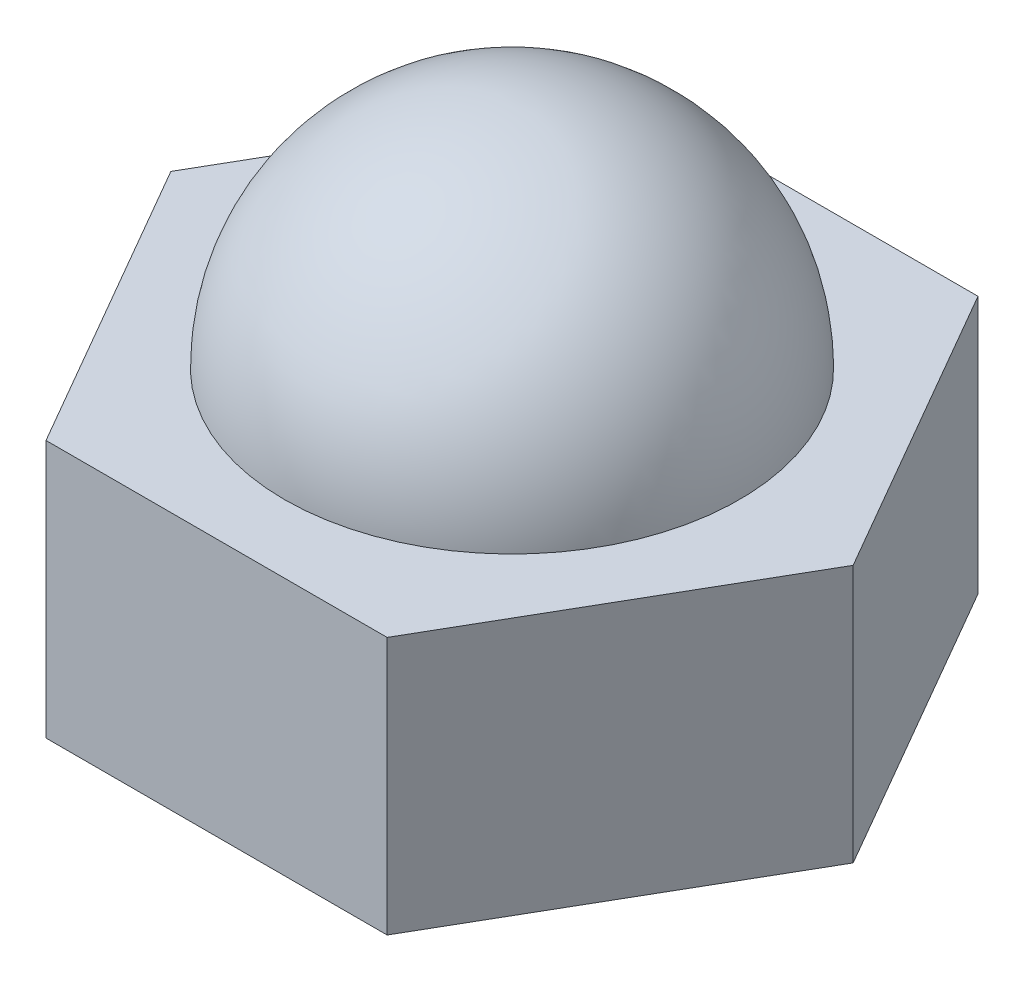
ISO-10303-21;
HEADER;
FILE_DESCRIPTION(('STEP AP214'),'2;1');
FILE_NAME('part.step','',(''),(''),'','','');
FILE_SCHEMA(('AUTOMOTIVE_DESIGN { 1 0 10303 214 1 1 1 1 }'));
ENDSEC;
DATA;
#1=APPLICATION_CONTEXT('core data for automotive mechanical design processes');
#2=APPLICATION_PROTOCOL_DEFINITION('international standard','automotive_design',2000,#1);
#3=PRODUCT_CONTEXT('',#1,'mechanical');
#4=PRODUCT('Part','Part','',(#3));
#5=PRODUCT_RELATED_PRODUCT_CATEGORY('part','',(#4));
#6=PRODUCT_DEFINITION_FORMATION('','',#4);
#7=PRODUCT_DEFINITION_CONTEXT('part definition',#1,'design');
#8=PRODUCT_DEFINITION('design','',#6,#7);
#9=PRODUCT_DEFINITION_SHAPE('','',#8);
#10=(LENGTH_UNIT() NAMED_UNIT(*) SI_UNIT(.MILLI.,.METRE.));
#11=(NAMED_UNIT(*) PLANE_ANGLE_UNIT() SI_UNIT($,.RADIAN.));
#12=(NAMED_UNIT(*) SI_UNIT($,.STERADIAN.) SOLID_ANGLE_UNIT());
#13=UNCERTAINTY_MEASURE_WITH_UNIT(LENGTH_MEASURE(1.E-05),#10,'distance_accuracy_value','');
#14=(GEOMETRIC_REPRESENTATION_CONTEXT(3) GLOBAL_UNCERTAINTY_ASSIGNED_CONTEXT((#13)) GLOBAL_UNIT_ASSIGNED_CONTEXT((#10,
#11,#12)) REPRESENTATION_CONTEXT('',''));
#15=CARTESIAN_POINT('',(0.,0.,0.));
#16=DIRECTION('',(0.,0.,1.));
#17=DIRECTION('',(1.,0.,0.));
#18=AXIS2_PLACEMENT_3D('',#15,#16,#17);
#19=CARTESIAN_POINT('',(0.,3.4,0.));
#20=DIRECTION('',(0.,1.,0.));
#21=DIRECTION('',(0.,0.,1.));
#22=AXIS2_PLACEMENT_3D('',#19,#20,#21);
#23=PLANE('',#22);
#24=DIRECTION('',(-0.5,0.,-0.866025403784439));
#25=VECTOR('',#24,1.);
#26=CARTESIAN_POINT('',(4.5,3.4,0.));
#27=LINE('',#26,#25);
#28=CARTESIAN_POINT('',(4.5,3.4,0.));
#29=VERTEX_POINT('',#28);
#30=CARTESIAN_POINT('',(2.25,3.4,-3.89711431702998));
#31=VERTEX_POINT('',#30);
#32=EDGE_CURVE('E128',#29,#31,#27,.T.);
#33=ORIENTED_EDGE('',*,*,#32,.T.);
#34=DIRECTION('',(-1.,0.,0.));
#35=VECTOR('',#34,1.);
#36=CARTESIAN_POINT('',(2.25,3.4,-3.89711431702998));
#37=LINE('',#36,#35);
#38=CARTESIAN_POINT('',(-2.25,3.4,-3.89711431702998));
#39=VERTEX_POINT('',#38);
#40=EDGE_CURVE('E87',#31,#39,#37,.T.);
#41=ORIENTED_EDGE('',*,*,#40,.T.);
#42=DIRECTION('',(-0.5,0.,0.866025403784439));
#43=VECTOR('',#42,1.);
#44=CARTESIAN_POINT('',(-2.25,3.4,-3.89711431702998));
#45=LINE('',#44,#43);
#46=CARTESIAN_POINT('',(-4.5,3.4,0.));
#47=VERTEX_POINT('',#46);
#48=EDGE_CURVE('E100',#39,#47,#45,.T.);
#49=ORIENTED_EDGE('',*,*,#48,.T.);
#50=DIRECTION('',(0.5,0.,0.866025403784439));
#51=VECTOR('',#50,1.);
#52=CARTESIAN_POINT('',(-4.5,3.4,0.));
#53=LINE('',#52,#51);
#54=CARTESIAN_POINT('',(-2.25,3.4,3.89711431702997));
#55=VERTEX_POINT('',#54);
#56=EDGE_CURVE('E94',#47,#55,#53,.T.);
#57=ORIENTED_EDGE('',*,*,#56,.T.);
#58=DIRECTION('',(1.,0.,0.));
#59=VECTOR('',#58,1.);
#60=CARTESIAN_POINT('',(-2.25,3.4,3.89711431702997));
#61=LINE('',#60,#59);
#62=CARTESIAN_POINT('',(2.25,3.4,3.89711431702997));
#63=VERTEX_POINT('',#62);
#64=EDGE_CURVE('E98',#55,#63,#61,.T.);
#65=ORIENTED_EDGE('',*,*,#64,.T.);
#66=DIRECTION('',(0.5,0.,-0.866025403784438));
#67=VECTOR('',#66,1.);
#68=CARTESIAN_POINT('',(2.25,3.4,3.89711431702997));
#69=LINE('',#68,#67);
#70=EDGE_CURVE('E50',#63,#29,#69,.T.);
#71=ORIENTED_EDGE('',*,*,#70,.T.);
#72=EDGE_LOOP('',(#33,#41,#49,#57,#65,#71));
#73=FACE_BOUND('',#72,.T.);
#74=CARTESIAN_POINT('',(0.,3.4,0.));
#75=DIRECTION('',(0.,1.,0.));
#76=DIRECTION('',(0.,0.,1.));
#77=AXIS2_PLACEMENT_3D('',#74,#75,#76);
#78=CIRCLE('',#77,3.);
#79=CARTESIAN_POINT('',(0.,3.4,3.));
#80=VERTEX_POINT('',#79);
#81=EDGE_CURVE('E36',#80,#80,#78,.F.);
#82=ORIENTED_EDGE('',*,*,#81,.T.);
#83=EDGE_LOOP('',(#82));
#84=FACE_BOUND('',#83,.T.);
#85=ADVANCED_FACE('F32',(#73,#84),#23,.T.);
#86=CARTESIAN_POINT('',(4.5,3.4,0.));
#87=DIRECTION('',(-0.866025403784439,0.,0.5));
#88=DIRECTION('',(0.5,0.,0.866025403784439));
#89=AXIS2_PLACEMENT_3D('',#86,#87,#88);
#90=PLANE('',#89);
#91=DIRECTION('',(-0.5,0.,-0.866025403784439));
#92=VECTOR('',#91,1.);
#93=CARTESIAN_POINT('',(4.5,0.,0.));
#94=LINE('',#93,#92);
#95=CARTESIAN_POINT('',(4.5,0.,0.));
#96=VERTEX_POINT('',#95);
#97=CARTESIAN_POINT('',(2.25,0.,-3.89711431702998));
#98=VERTEX_POINT('',#97);
#99=EDGE_CURVE('E118',#96,#98,#94,.T.);
#100=ORIENTED_EDGE('',*,*,#99,.T.);
#101=DIRECTION('',(0.,-1.,0.));
#102=VECTOR('',#101,1.);
#103=CARTESIAN_POINT('',(2.25,3.4,-3.89711431702998));
#104=LINE('',#103,#102);
#105=EDGE_CURVE('E11',#31,#98,#104,.T.);
#106=ORIENTED_EDGE('',*,*,#105,.F.);
#107=ORIENTED_EDGE('',*,*,#32,.F.);
#108=DIRECTION('',(0.,-1.,0.));
#109=VECTOR('',#108,1.);
#110=CARTESIAN_POINT('',(4.5,3.4,0.));
#111=LINE('',#110,#109);
#112=EDGE_CURVE('E114',#29,#96,#111,.T.);
#113=ORIENTED_EDGE('',*,*,#112,.T.);
#114=EDGE_LOOP('',(#100,#106,#107,#113));
#115=FACE_BOUND('',#114,.T.);
#116=ADVANCED_FACE('F34',(#115),#90,.F.);
#117=CARTESIAN_POINT('',(2.25,3.4,-3.89711431702998));
#118=DIRECTION('',(0.,0.,1.));
#119=DIRECTION('',(1.,0.,0.));
#120=AXIS2_PLACEMENT_3D('',#117,#118,#119);
#121=PLANE('',#120);
#122=DIRECTION('',(-1.,0.,0.));
#123=VECTOR('',#122,1.);
#124=CARTESIAN_POINT('',(2.25,0.,-3.89711431702998));
#125=LINE('',#124,#123);
#126=CARTESIAN_POINT('',(-2.25,0.,-3.89711431702998));
#127=VERTEX_POINT('',#126);
#128=EDGE_CURVE('E121',#98,#127,#125,.T.);
#129=ORIENTED_EDGE('',*,*,#128,.T.);
#130=DIRECTION('',(0.,-1.,0.));
#131=VECTOR('',#130,1.);
#132=CARTESIAN_POINT('',(-2.25,3.4,-3.89711431702998));
#133=LINE('',#132,#131);
#134=EDGE_CURVE('E42',#39,#127,#133,.T.);
#135=ORIENTED_EDGE('',*,*,#134,.F.);
#136=ORIENTED_EDGE('',*,*,#40,.F.);
#137=ORIENTED_EDGE('',*,*,#105,.T.);
#138=EDGE_LOOP('',(#129,#135,#136,#137));
#139=FACE_BOUND('',#138,.T.);
#140=ADVANCED_FACE('F158',(#139),#121,.F.);
#141=CARTESIAN_POINT('',(-2.25,3.4,-3.89711431702998));
#142=DIRECTION('',(0.866025403784439,0.,0.5));
#143=DIRECTION('',(0.5,0.,-0.866025403784439));
#144=AXIS2_PLACEMENT_3D('',#141,#142,#143);
#145=PLANE('',#144);
#146=DIRECTION('',(-0.5,0.,0.866025403784439));
#147=VECTOR('',#146,1.);
#148=CARTESIAN_POINT('',(-2.25,0.,-3.89711431702998));
#149=LINE('',#148,#147);
#150=CARTESIAN_POINT('',(-4.5,0.,0.));
#151=VERTEX_POINT('',#150);
#152=EDGE_CURVE('E123',#127,#151,#149,.T.);
#153=ORIENTED_EDGE('',*,*,#152,.T.);
#154=DIRECTION('',(0.,-1.,0.));
#155=VECTOR('',#154,1.);
#156=CARTESIAN_POINT('',(-4.5,3.4,0.));
#157=LINE('',#156,#155);
#158=EDGE_CURVE('E109',#47,#151,#157,.T.);
#159=ORIENTED_EDGE('',*,*,#158,.F.);
#160=ORIENTED_EDGE('',*,*,#48,.F.);
#161=ORIENTED_EDGE('',*,*,#134,.T.);
#162=EDGE_LOOP('',(#153,#159,#160,#161));
#163=FACE_BOUND('',#162,.T.);
#164=ADVANCED_FACE('F135',(#163),#145,.F.);
#165=CARTESIAN_POINT('',(-4.5,3.4,0.));
#166=DIRECTION('',(0.866025403784439,0.,-0.5));
#167=DIRECTION('',(-0.5,0.,-0.866025403784439));
#168=AXIS2_PLACEMENT_3D('',#165,#166,#167);
#169=PLANE('',#168);
#170=DIRECTION('',(0.5,0.,0.866025403784439));
#171=VECTOR('',#170,1.);
#172=CARTESIAN_POINT('',(-4.5,0.,0.));
#173=LINE('',#172,#171);
#174=CARTESIAN_POINT('',(-2.25,0.,3.89711431702997));
#175=VERTEX_POINT('',#174);
#176=EDGE_CURVE('E108',#151,#175,#173,.T.);
#177=ORIENTED_EDGE('',*,*,#176,.T.);
#178=DIRECTION('',(0.,-1.,0.));
#179=VECTOR('',#178,1.);
#180=CARTESIAN_POINT('',(-2.25,3.4,3.89711431702997));
#181=LINE('',#180,#179);
#182=EDGE_CURVE('E105',#55,#175,#181,.T.);
#183=ORIENTED_EDGE('',*,*,#182,.F.);
#184=ORIENTED_EDGE('',*,*,#56,.F.);
#185=ORIENTED_EDGE('',*,*,#158,.T.);
#186=EDGE_LOOP('',(#177,#183,#184,#185));
#187=FACE_BOUND('',#186,.T.);
#188=ADVANCED_FACE('F106',(#187),#169,.F.);
#189=CARTESIAN_POINT('',(-2.25,3.4,3.89711431702997));
#190=DIRECTION('',(0.,0.,-1.));
#191=DIRECTION('',(-1.,0.,0.));
#192=AXIS2_PLACEMENT_3D('',#189,#190,#191);
#193=PLANE('',#192);
#194=DIRECTION('',(1.,0.,0.));
#195=VECTOR('',#194,1.);
#196=CARTESIAN_POINT('',(-2.25,0.,3.89711431702997));
#197=LINE('',#196,#195);
#198=CARTESIAN_POINT('',(2.25,0.,3.89711431702997));
#199=VERTEX_POINT('',#198);
#200=EDGE_CURVE('E73',#175,#199,#197,.T.);
#201=ORIENTED_EDGE('',*,*,#200,.T.);
#202=DIRECTION('',(0.,-1.,0.));
#203=VECTOR('',#202,1.);
#204=CARTESIAN_POINT('',(2.25,3.4,3.89711431702997));
#205=LINE('',#204,#203);
#206=EDGE_CURVE('E110',#63,#199,#205,.T.);
#207=ORIENTED_EDGE('',*,*,#206,.F.);
#208=ORIENTED_EDGE('',*,*,#64,.F.);
#209=ORIENTED_EDGE('',*,*,#182,.T.);
#210=EDGE_LOOP('',(#201,#207,#208,#209));
#211=FACE_BOUND('',#210,.T.);
#212=ADVANCED_FACE('F112',(#211),#193,.F.);
#213=CARTESIAN_POINT('',(2.25,3.4,3.89711431702997));
#214=DIRECTION('',(-0.866025403784438,0.,-0.5));
#215=DIRECTION('',(-0.5,0.,0.866025403784439));
#216=AXIS2_PLACEMENT_3D('',#213,#214,#215);
#217=PLANE('',#216);
#218=DIRECTION('',(0.5,0.,-0.866025403784438));
#219=VECTOR('',#218,1.);
#220=CARTESIAN_POINT('',(2.25,0.,3.89711431702997));
#221=LINE('',#220,#219);
#222=EDGE_CURVE('E79',#199,#96,#221,.T.);
#223=ORIENTED_EDGE('',*,*,#222,.T.);
#224=ORIENTED_EDGE('',*,*,#112,.F.);
#225=ORIENTED_EDGE('',*,*,#70,.F.);
#226=ORIENTED_EDGE('',*,*,#206,.T.);
#227=EDGE_LOOP('',(#223,#224,#225,#226));
#228=FACE_BOUND('',#227,.T.);
#229=ADVANCED_FACE('F142',(#228),#217,.F.);
#230=CARTESIAN_POINT('',(0.,0.,0.));
#231=DIRECTION('',(0.,1.,0.));
#232=DIRECTION('',(0.,0.,1.));
#233=AXIS2_PLACEMENT_3D('',#230,#231,#232);
#234=PLANE('',#233);
#235=CARTESIAN_POINT('',(0.,0.,0.));
#236=DIRECTION('',(0.,-1.,0.));
#237=DIRECTION('',(0.,0.,-1.));
#238=AXIS2_PLACEMENT_3D('',#235,#236,#237);
#239=CIRCLE('',#238,2.5);
#240=CARTESIAN_POINT('',(0.,0.,-2.5));
#241=VERTEX_POINT('',#240);
#242=EDGE_CURVE('E175',#241,#241,#239,.T.);
#243=ORIENTED_EDGE('',*,*,#242,.F.);
#244=EDGE_LOOP('',(#243));
#245=FACE_BOUND('',#244,.T.);
#246=ORIENTED_EDGE('',*,*,#99,.F.);
#247=ORIENTED_EDGE('',*,*,#222,.F.);
#248=ORIENTED_EDGE('',*,*,#200,.F.);
#249=ORIENTED_EDGE('',*,*,#176,.F.);
#250=ORIENTED_EDGE('',*,*,#152,.F.);
#251=ORIENTED_EDGE('',*,*,#128,.F.);
#252=EDGE_LOOP('',(#246,#247,#248,#249,#250,#251));
#253=FACE_BOUND('',#252,.T.);
#254=ADVANCED_FACE('F138',(#245,#253),#234,.F.);
#255=CARTESIAN_POINT('',(0.,3.4,0.));
#256=DIRECTION('',(0.,0.,-1.));
#257=DIRECTION('',(1.,0.,0.));
#258=AXIS2_PLACEMENT_3D('',#255,#256,#257);
#259=SPHERICAL_SURFACE('',#258,3.);
#260=CARTESIAN_POINT('',(0.,3.4,0.));
#261=DIRECTION('',(0.,1.,0.));
#262=DIRECTION('',(0.,0.,1.));
#263=AXIS2_PLACEMENT_3D('',#260,#261,#262);
#264=SPHERICAL_SURFACE('',#263,3.);
#265=ORIENTED_EDGE('',*,*,#81,.F.);
#266=EDGE_LOOP('',(#265));
#267=FACE_BOUND('',#266,.T.);
#268=ADVANCED_FACE('F149',(#267),#264,.T.);
#269=CARTESIAN_POINT('',(0.,1.2,0.));
#270=DIRECTION('',(0.,-1.,0.));
#271=DIRECTION('',(0.,0.,-1.));
#272=AXIS2_PLACEMENT_3D('',#269,#270,#271);
#273=CYLINDRICAL_SURFACE('',#272,2.5);
#274=CARTESIAN_POINT('',(0.,1.2,0.));
#275=DIRECTION('',(0.,-1.,0.));
#276=DIRECTION('',(0.,0.,-1.));
#277=AXIS2_PLACEMENT_3D('',#274,#275,#276);
#278=CIRCLE('',#277,2.5);
#279=CARTESIAN_POINT('',(0.,1.2,-2.5));
#280=VERTEX_POINT('',#279);
#281=EDGE_CURVE('E174',#280,#280,#278,.T.);
#282=ORIENTED_EDGE('',*,*,#281,.F.);
#283=EDGE_LOOP('',(#282));
#284=FACE_BOUND('',#283,.T.);
#285=ORIENTED_EDGE('',*,*,#242,.T.);
#286=EDGE_LOOP('',(#285));
#287=FACE_BOUND('',#286,.T.);
#288=ADVANCED_FACE('F162',(#284,#287),#273,.F.);
#289=CARTESIAN_POINT('',(0.,1.2,0.));
#290=DIRECTION('',(0.,-1.,0.));
#291=DIRECTION('',(0.,0.,-1.));
#292=AXIS2_PLACEMENT_3D('',#289,#290,#291);
#293=PLANE('',#292);
#294=ORIENTED_EDGE('',*,*,#281,.T.);
#295=EDGE_LOOP('',(#294));
#296=FACE_BOUND('',#295,.T.);
#297=ADVANCED_FACE('F166',(#296),#293,.T.);
#298=CLOSED_SHELL('',(#85,#116,#140,#164,#188,#212,#229,#254,#268,#288,#297));
#299=MANIFOLD_SOLID_BREP('B2',#298);
#300=ADVANCED_BREP_SHAPE_REPRESENTATION('',(#18,#299),#14);
#301=SHAPE_DEFINITION_REPRESENTATION(#9,#300);
ENDSEC;
END-ISO-10303-21;
